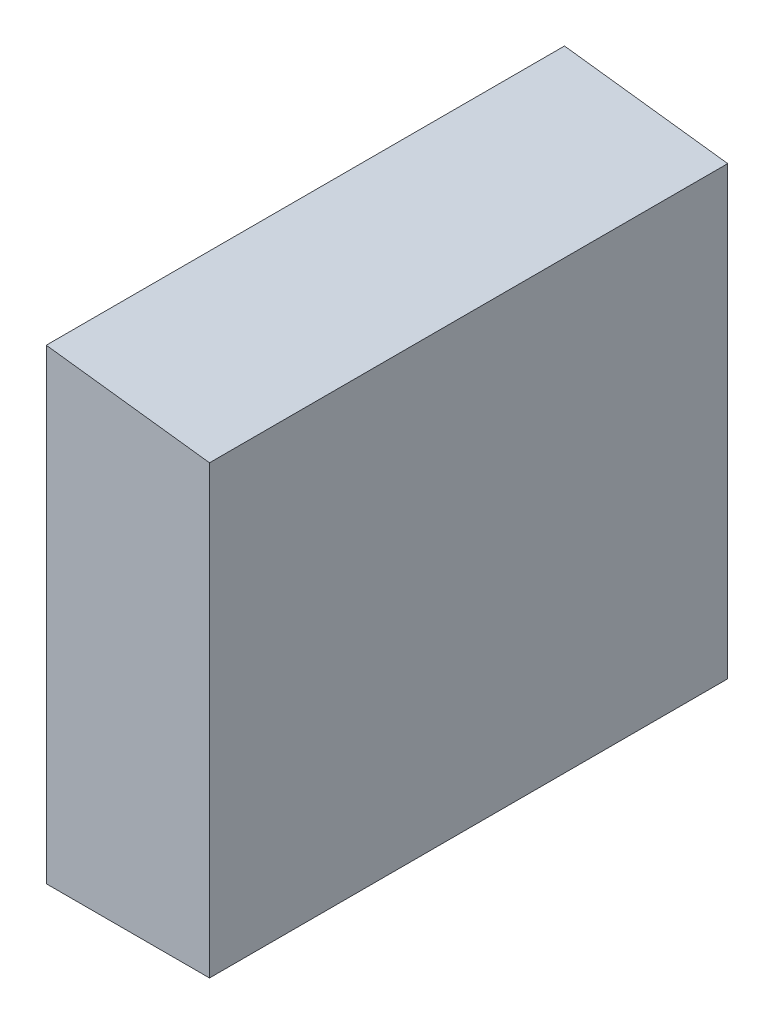
ISO-10303-21;
HEADER;
FILE_DESCRIPTION(('STEP AP214'),'2;1');
FILE_NAME('part.step','',(''),(''),'','','');
FILE_SCHEMA(('AUTOMOTIVE_DESIGN { 1 0 10303 214 1 1 1 1 }'));
ENDSEC;
DATA;
#1=APPLICATION_CONTEXT('core data for automotive mechanical design processes');
#2=APPLICATION_PROTOCOL_DEFINITION('international standard','automotive_design',2000,#1);
#3=PRODUCT_CONTEXT('',#1,'mechanical');
#4=PRODUCT('Part','Part','',(#3));
#5=PRODUCT_RELATED_PRODUCT_CATEGORY('part','',(#4));
#6=PRODUCT_DEFINITION_FORMATION('','',#4);
#7=PRODUCT_DEFINITION_CONTEXT('part definition',#1,'design');
#8=PRODUCT_DEFINITION('design','',#6,#7);
#9=PRODUCT_DEFINITION_SHAPE('','',#8);
#10=(LENGTH_UNIT() NAMED_UNIT(*) SI_UNIT(.MILLI.,.METRE.));
#11=(NAMED_UNIT(*) PLANE_ANGLE_UNIT() SI_UNIT($,.RADIAN.));
#12=(NAMED_UNIT(*) SI_UNIT($,.STERADIAN.) SOLID_ANGLE_UNIT());
#13=UNCERTAINTY_MEASURE_WITH_UNIT(LENGTH_MEASURE(1.E-05),#10,'distance_accuracy_value','');
#14=(GEOMETRIC_REPRESENTATION_CONTEXT(3) GLOBAL_UNCERTAINTY_ASSIGNED_CONTEXT((#13)) GLOBAL_UNIT_ASSIGNED_CONTEXT((#10,
#11,#12)) REPRESENTATION_CONTEXT('',''));
#15=CARTESIAN_POINT('',(0.,0.,0.));
#16=DIRECTION('',(0.,0.,1.));
#17=DIRECTION('',(1.,0.,0.));
#18=AXIS2_PLACEMENT_3D('',#15,#16,#17);
#19=CARTESIAN_POINT('',(1.57500066,4.11000194,0.));
#20=DIRECTION('',(1.,0.,0.));
#21=DIRECTION('',(0.,0.,-1.));
#22=AXIS2_PLACEMENT_3D('',#19,#20,#21);
#23=PLANE('',#22);
#24=DIRECTION('',(0.,0.,1.));
#25=VECTOR('',#24,1.);
#26=CARTESIAN_POINT('',(1.57500066000009,4.11000194000071,0.));
#27=LINE('',#26,#25);
#28=CARTESIAN_POINT('',(1.57500066000004,4.11000194000035,10.));
#29=VERTEX_POINT('',#28);
#30=CARTESIAN_POINT('',(1.57500066000002,4.11000194000018,0.));
#31=VERTEX_POINT('',#30);
#32=EDGE_CURVE('E20',#29,#31,#27,.F.);
#33=ORIENTED_EDGE('',*,*,#32,.F.);
#34=DIRECTION('',(0.,1.,0.));
#35=VECTOR('',#34,1.);
#36=CARTESIAN_POINT('',(1.57500066,-4.49999862,10.));
#37=LINE('',#36,#35);
#38=CARTESIAN_POINT('',(1.57500066,-4.49999862,10.));
#39=VERTEX_POINT('',#38);
#40=EDGE_CURVE('E81',#39,#29,#37,.T.);
#41=ORIENTED_EDGE('',*,*,#40,.F.);
#42=DIRECTION('',(0.,0.,-1.));
#43=VECTOR('',#42,1.);
#44=CARTESIAN_POINT('',(1.57500066,-4.49999862,0.));
#45=LINE('',#44,#43);
#46=CARTESIAN_POINT('',(1.57500066,-4.49999862,0.));
#47=VERTEX_POINT('',#46);
#48=EDGE_CURVE('E61',#47,#39,#45,.F.);
#49=ORIENTED_EDGE('',*,*,#48,.F.);
#50=DIRECTION('',(0.,1.,0.));
#51=VECTOR('',#50,1.);
#52=CARTESIAN_POINT('',(1.57500066,-4.49999862,0.));
#53=LINE('',#52,#51);
#54=EDGE_CURVE('E55',#47,#31,#53,.T.);
#55=ORIENTED_EDGE('',*,*,#54,.T.);
#56=EDGE_LOOP('',(#33,#41,#49,#55));
#57=FACE_BOUND('',#56,.T.);
#58=ADVANCED_FACE('F17',(#57),#23,.T.);
#59=CARTESIAN_POINT('',(-1.57499812,4.50000116,0.));
#60=DIRECTION('',(0.122871174948013,0.992422628907108,0.));
#61=DIRECTION('',(-0.992422628907108,0.122871174948013,0.));
#62=AXIS2_PLACEMENT_3D('',#59,#60,#61);
#63=PLANE('',#62);
#64=DIRECTION('',(0.,0.,1.));
#65=VECTOR('',#64,1.);
#66=CARTESIAN_POINT('',(-1.57499812,4.50000116,0.));
#67=LINE('',#66,#65);
#68=CARTESIAN_POINT('',(-1.57499812,4.50000116,10.));
#69=VERTEX_POINT('',#68);
#70=CARTESIAN_POINT('',(-1.57499812,4.50000116,0.));
#71=VERTEX_POINT('',#70);
#72=EDGE_CURVE('E83',#69,#71,#67,.F.);
#73=ORIENTED_EDGE('',*,*,#72,.F.);
#74=DIRECTION('',(-0.99242262890708,0.122871174948236,0.));
#75=VECTOR('',#74,1.);
#76=CARTESIAN_POINT('',(1.57500066,4.11000194,10.));
#77=LINE('',#76,#75);
#78=EDGE_CURVE('E68',#29,#69,#77,.T.);
#79=ORIENTED_EDGE('',*,*,#78,.F.);
#80=ORIENTED_EDGE('',*,*,#32,.T.);
#81=DIRECTION('',(-0.99242262890708,0.122871174948236,0.));
#82=VECTOR('',#81,1.);
#83=CARTESIAN_POINT('',(1.57500066,4.11000194,0.));
#84=LINE('',#83,#82);
#85=EDGE_CURVE('E63',#31,#71,#84,.T.);
#86=ORIENTED_EDGE('',*,*,#85,.T.);
#87=EDGE_LOOP('',(#73,#79,#80,#86));
#88=FACE_BOUND('',#87,.T.);
#89=ADVANCED_FACE('F65',(#88),#63,.T.);
#90=CARTESIAN_POINT('',(-1.57499812,-4.49999862,0.));
#91=DIRECTION('',(0.,0.,1.));
#92=DIRECTION('',(1.,0.,0.));
#93=AXIS2_PLACEMENT_3D('',#90,#91,#92);
#94=PLANE('',#93);
#95=ORIENTED_EDGE('',*,*,#54,.F.);
#96=DIRECTION('',(1.,0.,0.));
#97=VECTOR('',#96,1.);
#98=CARTESIAN_POINT('',(1.57500066,-4.49999862,0.));
#99=LINE('',#98,#97);
#100=CARTESIAN_POINT('',(-1.57499812,-4.49999862,0.));
#101=VERTEX_POINT('',#100);
#102=EDGE_CURVE('E74',#101,#47,#99,.T.);
#103=ORIENTED_EDGE('',*,*,#102,.F.);
#104=DIRECTION('',(0.,1.,0.));
#105=VECTOR('',#104,1.);
#106=CARTESIAN_POINT('',(-1.57499812,-4.49999862,0.));
#107=LINE('',#106,#105);
#108=EDGE_CURVE('E72',#71,#101,#107,.F.);
#109=ORIENTED_EDGE('',*,*,#108,.F.);
#110=ORIENTED_EDGE('',*,*,#85,.F.);
#111=EDGE_LOOP('',(#95,#103,#109,#110));
#112=FACE_BOUND('',#111,.T.);
#113=ADVANCED_FACE('F70',(#112),#94,.F.);
#114=CARTESIAN_POINT('',(1.57500066,-4.49999862,0.));
#115=DIRECTION('',(0.,-1.,0.));
#116=DIRECTION('',(0.,0.,-1.));
#117=AXIS2_PLACEMENT_3D('',#114,#115,#116);
#118=PLANE('',#117);
#119=ORIENTED_EDGE('',*,*,#48,.T.);
#120=DIRECTION('',(1.,0.,0.));
#121=VECTOR('',#120,1.);
#122=CARTESIAN_POINT('',(-1.57499812,-4.49999862,10.));
#123=LINE('',#122,#121);
#124=CARTESIAN_POINT('',(-1.57499812,-4.49999862,10.));
#125=VERTEX_POINT('',#124);
#126=EDGE_CURVE('E35',#125,#39,#123,.T.);
#127=ORIENTED_EDGE('',*,*,#126,.F.);
#128=DIRECTION('',(0.,0.,1.));
#129=VECTOR('',#128,1.);
#130=CARTESIAN_POINT('',(-1.57499812,-4.49999862,0.));
#131=LINE('',#130,#129);
#132=EDGE_CURVE('E26',#101,#125,#131,.T.);
#133=ORIENTED_EDGE('',*,*,#132,.F.);
#134=ORIENTED_EDGE('',*,*,#102,.T.);
#135=EDGE_LOOP('',(#119,#127,#133,#134));
#136=FACE_BOUND('',#135,.T.);
#137=ADVANCED_FACE('F89',(#136),#118,.T.);
#138=CARTESIAN_POINT('',(-1.57499812,-4.49999862,10.));
#139=DIRECTION('',(0.,0.,1.));
#140=DIRECTION('',(1.,0.,0.));
#141=AXIS2_PLACEMENT_3D('',#138,#139,#140);
#142=PLANE('',#141);
#143=ORIENTED_EDGE('',*,*,#126,.T.);
#144=ORIENTED_EDGE('',*,*,#40,.T.);
#145=ORIENTED_EDGE('',*,*,#78,.T.);
#146=DIRECTION('',(0.,1.,0.));
#147=VECTOR('',#146,1.);
#148=CARTESIAN_POINT('',(-1.57499812,-4.49999862,10.));
#149=LINE('',#148,#147);
#150=EDGE_CURVE('E11',#125,#69,#149,.T.);
#151=ORIENTED_EDGE('',*,*,#150,.F.);
#152=EDGE_LOOP('',(#143,#144,#145,#151));
#153=FACE_BOUND('',#152,.T.);
#154=ADVANCED_FACE('F91',(#153),#142,.T.);
#155=CARTESIAN_POINT('',(-1.57499812,-4.49999862,0.));
#156=DIRECTION('',(-1.,0.,0.));
#157=DIRECTION('',(0.,0.,1.));
#158=AXIS2_PLACEMENT_3D('',#155,#156,#157);
#159=PLANE('',#158);
#160=ORIENTED_EDGE('',*,*,#132,.T.);
#161=ORIENTED_EDGE('',*,*,#150,.T.);
#162=ORIENTED_EDGE('',*,*,#72,.T.);
#163=ORIENTED_EDGE('',*,*,#108,.T.);
#164=EDGE_LOOP('',(#160,#161,#162,#163));
#165=FACE_BOUND('',#164,.T.);
#166=ADVANCED_FACE('F88',(#165),#159,.T.);
#167=CLOSED_SHELL('',(#58,#89,#113,#137,#154,#166));
#168=MANIFOLD_SOLID_BREP('B1',#167);
#169=ADVANCED_BREP_SHAPE_REPRESENTATION('',(#18,#168),#14);
#170=SHAPE_DEFINITION_REPRESENTATION(#9,#169);
ENDSEC;
END-ISO-10303-21;
